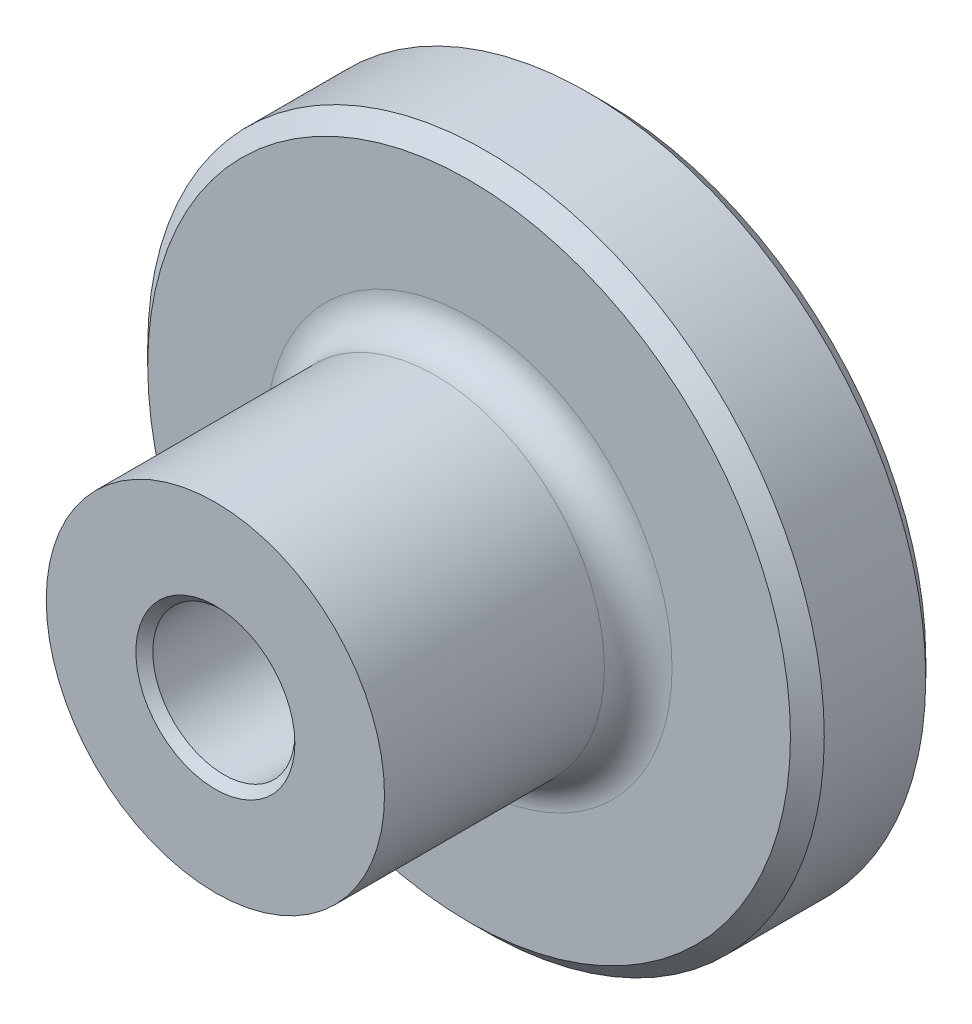
ISO-10303-21;
HEADER;
FILE_DESCRIPTION(('STEP AP214'),'2;1');
FILE_NAME('part.step','',(''),(''),'','','');
FILE_SCHEMA(('AUTOMOTIVE_DESIGN { 1 0 10303 214 1 1 1 1 }'));
ENDSEC;
DATA;
#1=APPLICATION_CONTEXT('core data for automotive mechanical design processes');
#2=APPLICATION_PROTOCOL_DEFINITION('international standard','automotive_design',2000,#1);
#3=PRODUCT_CONTEXT('',#1,'mechanical');
#4=PRODUCT('Part','Part','',(#3));
#5=PRODUCT_RELATED_PRODUCT_CATEGORY('part','',(#4));
#6=PRODUCT_DEFINITION_FORMATION('','',#4);
#7=PRODUCT_DEFINITION_CONTEXT('part definition',#1,'design');
#8=PRODUCT_DEFINITION('design','',#6,#7);
#9=PRODUCT_DEFINITION_SHAPE('','',#8);
#10=(LENGTH_UNIT() NAMED_UNIT(*) SI_UNIT(.MILLI.,.METRE.));
#11=(NAMED_UNIT(*) PLANE_ANGLE_UNIT() SI_UNIT($,.RADIAN.));
#12=(NAMED_UNIT(*) SI_UNIT($,.STERADIAN.) SOLID_ANGLE_UNIT());
#13=UNCERTAINTY_MEASURE_WITH_UNIT(LENGTH_MEASURE(1.E-05),#10,'distance_accuracy_value','');
#14=(GEOMETRIC_REPRESENTATION_CONTEXT(3) GLOBAL_UNCERTAINTY_ASSIGNED_CONTEXT((#13)) GLOBAL_UNIT_ASSIGNED_CONTEXT((#10,
#11,#12)) REPRESENTATION_CONTEXT('',''));
#15=CARTESIAN_POINT('',(0.,0.,0.));
#16=DIRECTION('',(0.,0.,1.));
#17=DIRECTION('',(1.,0.,0.));
#18=AXIS2_PLACEMENT_3D('',#15,#16,#17);
#19=CARTESIAN_POINT('',(0.,0.,4.));
#20=DIRECTION('',(0.,0.,1.));
#21=DIRECTION('',(1.,0.,0.));
#22=AXIS2_PLACEMENT_3D('',#19,#20,#21);
#23=PLANE('',#22);
#24=CARTESIAN_POINT('',(0.,0.,4.));
#25=DIRECTION('',(0.,0.,1.));
#26=DIRECTION('',(1.,0.,0.));
#27=AXIS2_PLACEMENT_3D('',#24,#25,#26);
#28=CIRCLE('',#27,6.);
#29=CARTESIAN_POINT('',(6.,0.,4.));
#30=VERTEX_POINT('',#29);
#31=EDGE_CURVE('E45',#30,#30,#28,.F.);
#32=ORIENTED_EDGE('',*,*,#31,.T.);
#33=EDGE_LOOP('',(#32));
#34=FACE_BOUND('',#33,.T.);
#35=CARTESIAN_POINT('',(0.,0.,4.));
#36=DIRECTION('',(0.,0.,1.));
#37=DIRECTION('',(1.,0.,0.));
#38=AXIS2_PLACEMENT_3D('',#35,#36,#37);
#39=CIRCLE('',#38,9.49999999999999);
#40=CARTESIAN_POINT('',(9.49999999999999,0.,4.));
#41=VERTEX_POINT('',#40);
#42=EDGE_CURVE('E54',#41,#41,#39,.T.);
#43=ORIENTED_EDGE('',*,*,#42,.T.);
#44=EDGE_LOOP('',(#43));
#45=FACE_BOUND('',#44,.T.);
#46=ADVANCED_FACE('F34',(#34,#45),#23,.T.);
#47=CARTESIAN_POINT('',(0.,0.,0.));
#48=DIRECTION('',(0.,0.,1.));
#49=DIRECTION('',(1.,0.,0.));
#50=AXIS2_PLACEMENT_3D('',#47,#48,#49);
#51=PLANE('',#50);
#52=CARTESIAN_POINT('',(0.,0.,0.));
#53=DIRECTION('',(0.,0.,1.));
#54=DIRECTION('',(1.,0.,0.));
#55=AXIS2_PLACEMENT_3D('',#52,#53,#54);
#56=CIRCLE('',#55,9.5);
#57=CARTESIAN_POINT('',(9.5,0.,0.));
#58=VERTEX_POINT('',#57);
#59=EDGE_CURVE('E57',#58,#58,#56,.F.);
#60=ORIENTED_EDGE('',*,*,#59,.T.);
#61=EDGE_LOOP('',(#60));
#62=FACE_BOUND('',#61,.T.);
#63=CARTESIAN_POINT('',(0.,0.,0.));
#64=DIRECTION('',(0.,0.,1.));
#65=DIRECTION('',(1.,0.,0.));
#66=AXIS2_PLACEMENT_3D('',#63,#64,#65);
#67=CIRCLE('',#66,2.1);
#68=CARTESIAN_POINT('',(2.1,0.,0.));
#69=VERTEX_POINT('',#68);
#70=EDGE_CURVE('E66',#69,#69,#67,.T.);
#71=ORIENTED_EDGE('',*,*,#70,.T.);
#72=EDGE_LOOP('',(#71));
#73=FACE_BOUND('',#72,.T.);
#74=ADVANCED_FACE('F91',(#62,#73),#51,.F.);
#75=CARTESIAN_POINT('',(0.,0.,4.));
#76=DIRECTION('',(0.,0.,-1.));
#77=DIRECTION('',(-1.,0.,0.));
#78=AXIS2_PLACEMENT_3D('',#75,#76,#77);
#79=CYLINDRICAL_SURFACE('',#78,10.);
#80=CARTESIAN_POINT('',(0.,0.,0.5));
#81=DIRECTION('',(0.,0.,1.));
#82=DIRECTION('',(1.,0.,0.));
#83=AXIS2_PLACEMENT_3D('',#80,#81,#82);
#84=CIRCLE('',#83,10.);
#85=CARTESIAN_POINT('',(10.,0.,0.5));
#86=VERTEX_POINT('',#85);
#87=EDGE_CURVE('E60',#86,#86,#84,.T.);
#88=ORIENTED_EDGE('',*,*,#87,.T.);
#89=EDGE_LOOP('',(#88));
#90=FACE_BOUND('',#89,.T.);
#91=CARTESIAN_POINT('',(0.,0.,3.49999999999999));
#92=DIRECTION('',(0.,0.,1.));
#93=DIRECTION('',(1.,0.,0.));
#94=AXIS2_PLACEMENT_3D('',#91,#92,#93);
#95=CIRCLE('',#94,10.);
#96=CARTESIAN_POINT('',(10.,0.,3.49999999999999));
#97=VERTEX_POINT('',#96);
#98=EDGE_CURVE('E63',#97,#97,#95,.F.);
#99=ORIENTED_EDGE('',*,*,#98,.T.);
#100=EDGE_LOOP('',(#99));
#101=FACE_BOUND('',#100,.T.);
#102=ADVANCED_FACE('F97',(#90,#101),#79,.T.);
#103=CARTESIAN_POINT('',(0.,0.,4.));
#104=DIRECTION('',(0.,0.,-1.));
#105=DIRECTION('',(-1.,0.,0.));
#106=AXIS2_PLACEMENT_3D('',#103,#104,#105);
#107=CYLINDRICAL_SURFACE('',#106,2.1);
#108=CARTESIAN_POINT('',(0.,0.,11.25));
#109=DIRECTION('',(0.,0.,1.));
#110=DIRECTION('',(1.,0.,0.));
#111=AXIS2_PLACEMENT_3D('',#108,#109,#110);
#112=CIRCLE('',#111,2.1);
#113=CARTESIAN_POINT('',(2.1,0.,11.25));
#114=VERTEX_POINT('',#113);
#115=EDGE_CURVE('E41',#114,#114,#112,.T.);
#116=ORIENTED_EDGE('',*,*,#115,.T.);
#117=EDGE_LOOP('',(#116));
#118=FACE_BOUND('',#117,.T.);
#119=ORIENTED_EDGE('',*,*,#70,.F.);
#120=EDGE_LOOP('',(#119));
#121=FACE_BOUND('',#120,.T.);
#122=ADVANCED_FACE('F87',(#118,#121),#107,.F.);
#123=CARTESIAN_POINT('',(0.,0.,11.5));
#124=DIRECTION('',(0.,0.,1.));
#125=DIRECTION('',(1.,0.,0.));
#126=AXIS2_PLACEMENT_3D('',#123,#124,#125);
#127=PLANE('',#126);
#128=CARTESIAN_POINT('',(0.,0.,11.5));
#129=DIRECTION('',(0.,0.,1.));
#130=DIRECTION('',(1.,0.,0.));
#131=AXIS2_PLACEMENT_3D('',#128,#129,#130);
#132=CIRCLE('',#131,2.35000000000001);
#133=CARTESIAN_POINT('',(2.35000000000001,0.,11.5));
#134=VERTEX_POINT('',#133);
#135=EDGE_CURVE('E10',#134,#134,#132,.F.);
#136=ORIENTED_EDGE('',*,*,#135,.T.);
#137=EDGE_LOOP('',(#136));
#138=FACE_BOUND('',#137,.T.);
#139=CARTESIAN_POINT('',(0.,0.,11.5));
#140=DIRECTION('',(0.,0.,1.));
#141=DIRECTION('',(1.,0.,0.));
#142=AXIS2_PLACEMENT_3D('',#139,#140,#141);
#143=CIRCLE('',#142,5.);
#144=CARTESIAN_POINT('',(5.,0.,11.5));
#145=VERTEX_POINT('',#144);
#146=EDGE_CURVE('E69',#145,#145,#143,.T.);
#147=ORIENTED_EDGE('',*,*,#146,.T.);
#148=EDGE_LOOP('',(#147));
#149=FACE_BOUND('',#148,.T.);
#150=ADVANCED_FACE('F73',(#138,#149),#127,.T.);
#151=CARTESIAN_POINT('',(0.,0.,11.5));
#152=DIRECTION('',(0.,0.,-1.));
#153=DIRECTION('',(-1.,0.,0.));
#154=AXIS2_PLACEMENT_3D('',#151,#152,#153);
#155=CYLINDRICAL_SURFACE('',#154,5.);
#156=CARTESIAN_POINT('',(0.,0.,5.));
#157=DIRECTION('',(0.,0.,1.));
#158=DIRECTION('',(1.,0.,0.));
#159=AXIS2_PLACEMENT_3D('',#156,#157,#158);
#160=CIRCLE('',#159,5.);
#161=CARTESIAN_POINT('',(5.,0.,5.));
#162=VERTEX_POINT('',#161);
#163=EDGE_CURVE('E49',#162,#162,#160,.T.);
#164=ORIENTED_EDGE('',*,*,#163,.T.);
#165=EDGE_LOOP('',(#164));
#166=FACE_BOUND('',#165,.T.);
#167=ORIENTED_EDGE('',*,*,#146,.F.);
#168=EDGE_LOOP('',(#167));
#169=FACE_BOUND('',#168,.T.);
#170=ADVANCED_FACE('F75',(#166,#169),#155,.T.);
#171=CARTESIAN_POINT('',(0.,0.,0.5));
#172=DIRECTION('',(0.,0.,1.));
#173=DIRECTION('',(1.,0.,0.));
#174=AXIS2_PLACEMENT_3D('',#171,#172,#173);
#175=CONICAL_SURFACE('',#174,10.,0.785398163397448);
#176=ORIENTED_EDGE('',*,*,#59,.F.);
#177=EDGE_LOOP('',(#176));
#178=FACE_BOUND('',#177,.T.);
#179=ORIENTED_EDGE('',*,*,#87,.F.);
#180=EDGE_LOOP('',(#179));
#181=FACE_BOUND('',#180,.T.);
#182=ADVANCED_FACE('F77',(#178,#181),#175,.T.);
#183=CARTESIAN_POINT('',(0.,0.,4.));
#184=DIRECTION('',(0.,0.,-1.));
#185=DIRECTION('',(-1.,0.,0.));
#186=AXIS2_PLACEMENT_3D('',#183,#184,#185);
#187=CONICAL_SURFACE('',#186,9.49999999999999,0.785398163397448);
#188=ORIENTED_EDGE('',*,*,#98,.F.);
#189=EDGE_LOOP('',(#188));
#190=FACE_BOUND('',#189,.T.);
#191=ORIENTED_EDGE('',*,*,#42,.F.);
#192=EDGE_LOOP('',(#191));
#193=FACE_BOUND('',#192,.T.);
#194=ADVANCED_FACE('F84',(#190,#193),#187,.T.);
#195=CARTESIAN_POINT('',(0.,0.,5.));
#196=DIRECTION('',(0.,0.,1.));
#197=DIRECTION('',(1.,0.,0.));
#198=AXIS2_PLACEMENT_3D('',#195,#196,#197);
#199=TOROIDAL_SURFACE('',#198,6.,1.);
#200=ORIENTED_EDGE('',*,*,#31,.F.);
#201=EDGE_LOOP('',(#200));
#202=FACE_BOUND('',#201,.T.);
#203=ORIENTED_EDGE('',*,*,#163,.F.);
#204=EDGE_LOOP('',(#203));
#205=FACE_BOUND('',#204,.T.);
#206=ADVANCED_FACE('F106',(#202,#205),#199,.F.);
#207=CARTESIAN_POINT('',(0.,0.,11.25));
#208=DIRECTION('',(0.,0.,1.));
#209=DIRECTION('',(1.,0.,0.));
#210=AXIS2_PLACEMENT_3D('',#207,#208,#209);
#211=CONICAL_SURFACE('',#210,2.1,0.785398163397447);
#212=ORIENTED_EDGE('',*,*,#135,.F.);
#213=EDGE_LOOP('',(#212));
#214=FACE_BOUND('',#213,.T.);
#215=ORIENTED_EDGE('',*,*,#115,.F.);
#216=EDGE_LOOP('',(#215));
#217=FACE_BOUND('',#216,.T.);
#218=ADVANCED_FACE('F36',(#214,#217),#211,.F.);
#219=CLOSED_SHELL('',(#46,#74,#102,#122,#150,#170,#182,#194,#206,#218));
#220=MANIFOLD_SOLID_BREP('B2',#219);
#221=ADVANCED_BREP_SHAPE_REPRESENTATION('',(#18,#220),#14);
#222=SHAPE_DEFINITION_REPRESENTATION(#9,#221);
ENDSEC;
END-ISO-10303-21;
